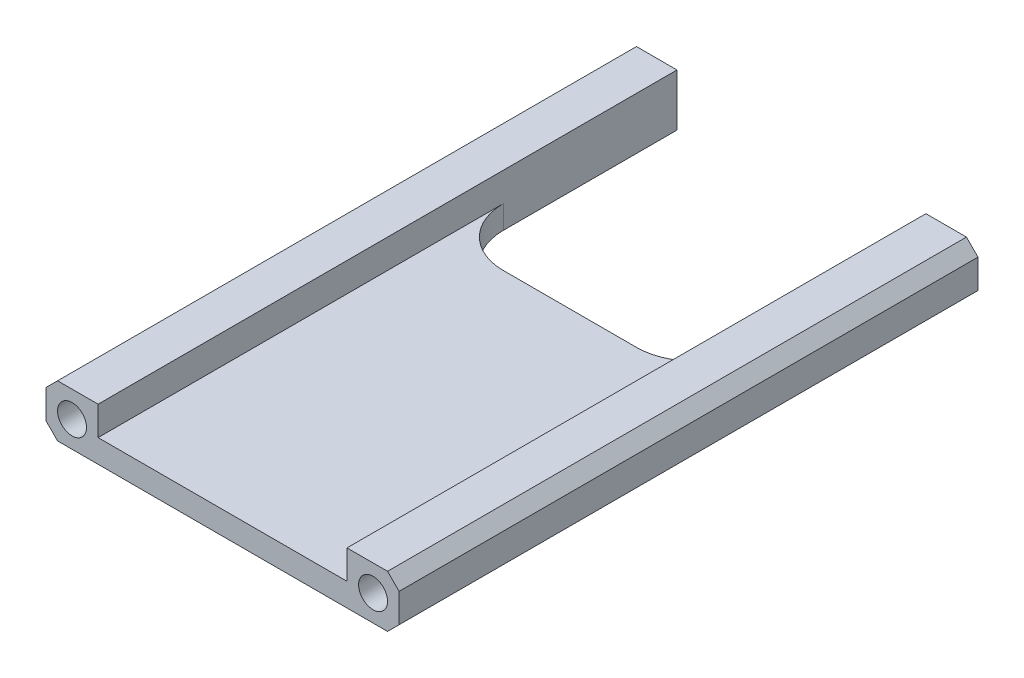
ISO-10303-21;
HEADER;
FILE_DESCRIPTION(('STEP AP214'),'2;1');
FILE_NAME('part.step','',(''),(''),'','','');
FILE_SCHEMA(('AUTOMOTIVE_DESIGN { 1 0 10303 214 1 1 1 1 }'));
ENDSEC;
DATA;
#1=APPLICATION_CONTEXT('core data for automotive mechanical design processes');
#2=APPLICATION_PROTOCOL_DEFINITION('international standard','automotive_design',2000,#1);
#3=PRODUCT_CONTEXT('',#1,'mechanical');
#4=PRODUCT('Part','Part','',(#3));
#5=PRODUCT_RELATED_PRODUCT_CATEGORY('part','',(#4));
#6=PRODUCT_DEFINITION_FORMATION('','',#4);
#7=PRODUCT_DEFINITION_CONTEXT('part definition',#1,'design');
#8=PRODUCT_DEFINITION('design','',#6,#7);
#9=PRODUCT_DEFINITION_SHAPE('','',#8);
#10=(LENGTH_UNIT() NAMED_UNIT(*) SI_UNIT(.MILLI.,.METRE.));
#11=(NAMED_UNIT(*) PLANE_ANGLE_UNIT() SI_UNIT($,.RADIAN.));
#12=(NAMED_UNIT(*) SI_UNIT($,.STERADIAN.) SOLID_ANGLE_UNIT());
#13=UNCERTAINTY_MEASURE_WITH_UNIT(LENGTH_MEASURE(1.E-05),#10,'distance_accuracy_value','');
#14=(GEOMETRIC_REPRESENTATION_CONTEXT(3) GLOBAL_UNCERTAINTY_ASSIGNED_CONTEXT((#13)) GLOBAL_UNIT_ASSIGNED_CONTEXT((#10,
#11,#12)) REPRESENTATION_CONTEXT('',''));
#15=CARTESIAN_POINT('',(0.,0.,0.));
#16=DIRECTION('',(0.,0.,1.));
#17=DIRECTION('',(1.,0.,0.));
#18=AXIS2_PLACEMENT_3D('',#15,#16,#17);
#19=CARTESIAN_POINT('',(0.,11.43,0.));
#20=DIRECTION('',(0.,-1.,0.));
#21=DIRECTION('',(0.,0.,-1.));
#22=AXIS2_PLACEMENT_3D('',#19,#20,#21);
#23=PLANE('',#22);
#24=DIRECTION('',(1.,0.,0.));
#25=VECTOR('',#24,1.);
#26=CARTESIAN_POINT('',(0.,11.43,0.));
#27=LINE('',#26,#25);
#28=CARTESIAN_POINT('',(66.04,11.43,0.));
#29=VERTEX_POINT('',#28);
#30=CARTESIAN_POINT('',(74.93,11.43,0.));
#31=VERTEX_POINT('',#30);
#32=EDGE_CURVE('E183',#29,#31,#27,.T.);
#33=ORIENTED_EDGE('',*,*,#32,.T.);
#34=DIRECTION('',(0.,0.,-1.));
#35=VECTOR('',#34,1.);
#36=CARTESIAN_POINT('',(74.93,11.43,0.));
#37=LINE('',#36,#35);
#38=CARTESIAN_POINT('',(74.93,11.43,-127.));
#39=VERTEX_POINT('',#38);
#40=EDGE_CURVE('E11',#31,#39,#37,.T.);
#41=ORIENTED_EDGE('',*,*,#40,.T.);
#42=DIRECTION('',(-1.,0.,0.));
#43=VECTOR('',#42,1.);
#44=CARTESIAN_POINT('',(0.,11.43,-127.));
#45=LINE('',#44,#43);
#46=CARTESIAN_POINT('',(66.04,11.43,-127.));
#47=VERTEX_POINT('',#46);
#48=EDGE_CURVE('E271',#39,#47,#45,.T.);
#49=ORIENTED_EDGE('',*,*,#48,.T.);
#50=DIRECTION('',(0.,0.,-1.));
#51=VECTOR('',#50,1.);
#52=CARTESIAN_POINT('',(66.04,11.43,-127.));
#53=LINE('',#52,#51);
#54=EDGE_CURVE('E208',#29,#47,#53,.T.);
#55=ORIENTED_EDGE('',*,*,#54,.F.);
#56=EDGE_LOOP('',(#33,#41,#49,#55));
#57=FACE_BOUND('',#56,.T.);
#58=ADVANCED_FACE('F40',(#57),#23,.F.);
#59=CARTESIAN_POINT('',(0.,11.43,-127.));
#60=DIRECTION('',(0.,0.,1.));
#61=DIRECTION('',(1.,0.,0.));
#62=AXIS2_PLACEMENT_3D('',#59,#60,#61);
#63=PLANE('',#62);
#64=CARTESIAN_POINT('',(71.755,5.71500000000001,-127.));
#65=DIRECTION('',(0.,0.,1.));
#66=DIRECTION('',(1.,0.,0.));
#67=AXIS2_PLACEMENT_3D('',#64,#65,#66);
#68=CIRCLE('',#67,3.175);
#69=CARTESIAN_POINT('',(74.93,5.71500000000001,-127.));
#70=VERTEX_POINT('',#69);
#71=EDGE_CURVE('E260',#70,#70,#68,.T.);
#72=ORIENTED_EDGE('',*,*,#71,.T.);
#73=EDGE_LOOP('',(#72));
#74=FACE_BOUND('',#73,.T.);
#75=DIRECTION('',(0.,-1.,0.));
#76=VECTOR('',#75,1.);
#77=CARTESIAN_POINT('',(77.47,11.43,-127.));
#78=LINE('',#77,#76);
#79=CARTESIAN_POINT('',(77.47,8.89,-127.));
#80=VERTEX_POINT('',#79);
#81=CARTESIAN_POINT('',(77.47,2.54000000000003,-127.));
#82=VERTEX_POINT('',#81);
#83=EDGE_CURVE('E285',#80,#82,#78,.T.);
#84=ORIENTED_EDGE('',*,*,#83,.T.);
#85=DIRECTION('',(-0.707106781186548,-0.707106781186548,0.));
#86=VECTOR('',#85,1.);
#87=CARTESIAN_POINT('',(77.47,2.54000000000003,-127.));
#88=LINE('',#87,#86);
#89=CARTESIAN_POINT('',(74.93,0.,-127.));
#90=VERTEX_POINT('',#89);
#91=EDGE_CURVE('E50',#82,#90,#88,.T.);
#92=ORIENTED_EDGE('',*,*,#91,.T.);
#93=DIRECTION('',(-1.,0.,0.));
#94=VECTOR('',#93,1.);
#95=CARTESIAN_POINT('',(0.,0.,-127.));
#96=LINE('',#95,#94);
#97=CARTESIAN_POINT('',(66.04,0.,-127.));
#98=VERTEX_POINT('',#97);
#99=EDGE_CURVE('E279',#90,#98,#96,.T.);
#100=ORIENTED_EDGE('',*,*,#99,.T.);
#101=DIRECTION('',(0.,1.,0.));
#102=VECTOR('',#101,1.);
#103=CARTESIAN_POINT('',(66.04,0.,-127.));
#104=LINE('',#103,#102);
#105=EDGE_CURVE('E230',#98,#47,#104,.T.);
#106=ORIENTED_EDGE('',*,*,#105,.T.);
#107=ORIENTED_EDGE('',*,*,#48,.F.);
#108=DIRECTION('',(-0.707106781186544,0.707106781186551,0.));
#109=VECTOR('',#108,1.);
#110=CARTESIAN_POINT('',(74.93,11.43,-127.));
#111=LINE('',#110,#109);
#112=EDGE_CURVE('E57',#39,#80,#111,.F.);
#113=ORIENTED_EDGE('',*,*,#112,.T.);
#114=EDGE_LOOP('',(#84,#92,#100,#106,#107,#113));
#115=FACE_BOUND('',#114,.T.);
#116=ADVANCED_FACE('F341',(#74,#115),#63,.F.);
#117=CARTESIAN_POINT('',(0.,11.43,0.));
#118=DIRECTION('',(1.,0.,0.));
#119=DIRECTION('',(0.,0.,-1.));
#120=AXIS2_PLACEMENT_3D('',#117,#118,#119);
#121=PLANE('',#120);
#122=DIRECTION('',(0.,-1.,0.));
#123=VECTOR('',#122,1.);
#124=CARTESIAN_POINT('',(0.,11.43,-127.));
#125=LINE('',#124,#123);
#126=CARTESIAN_POINT('',(0.,8.88999999999997,-127.));
#127=VERTEX_POINT('',#126);
#128=CARTESIAN_POINT('',(0.,2.54000000000003,-127.));
#129=VERTEX_POINT('',#128);
#130=EDGE_CURVE('E274',#127,#129,#125,.T.);
#131=ORIENTED_EDGE('',*,*,#130,.T.);
#132=DIRECTION('',(0.,0.,1.));
#133=VECTOR('',#132,1.);
#134=CARTESIAN_POINT('',(0.,2.54000000000003,0.));
#135=LINE('',#134,#133);
#136=CARTESIAN_POINT('',(0.,2.54000000000003,0.));
#137=VERTEX_POINT('',#136);
#138=EDGE_CURVE('E299',#129,#137,#135,.T.);
#139=ORIENTED_EDGE('',*,*,#138,.T.);
#140=DIRECTION('',(0.,-1.,0.));
#141=VECTOR('',#140,1.);
#142=CARTESIAN_POINT('',(0.,11.43,0.));
#143=LINE('',#142,#141);
#144=CARTESIAN_POINT('',(0.,8.88999999999997,0.));
#145=VERTEX_POINT('',#144);
#146=EDGE_CURVE('E293',#145,#137,#143,.T.);
#147=ORIENTED_EDGE('',*,*,#146,.F.);
#148=DIRECTION('',(0.,0.,-1.));
#149=VECTOR('',#148,1.);
#150=CARTESIAN_POINT('',(0.,8.88999999999997,0.));
#151=LINE('',#150,#149);
#152=EDGE_CURVE('E296',#145,#127,#151,.T.);
#153=ORIENTED_EDGE('',*,*,#152,.T.);
#154=EDGE_LOOP('',(#131,#139,#147,#153));
#155=FACE_BOUND('',#154,.T.);
#156=ADVANCED_FACE('F372',(#155),#121,.F.);
#157=CARTESIAN_POINT('',(0.,11.43,0.));
#158=DIRECTION('',(0.,0.,-1.));
#159=DIRECTION('',(-1.,0.,0.));
#160=AXIS2_PLACEMENT_3D('',#157,#158,#159);
#161=PLANE('',#160);
#162=ORIENTED_EDGE('',*,*,#146,.T.);
#163=DIRECTION('',(0.707106781186548,-0.707106781186548,0.));
#164=VECTOR('',#163,1.);
#165=CARTESIAN_POINT('',(0.,2.54000000000003,0.));
#166=LINE('',#165,#164);
#167=CARTESIAN_POINT('',(2.54000000000003,0.,0.));
#168=VERTEX_POINT('',#167);
#169=EDGE_CURVE('E312',#137,#168,#166,.T.);
#170=ORIENTED_EDGE('',*,*,#169,.T.);
#171=DIRECTION('',(1.,0.,0.));
#172=VECTOR('',#171,1.);
#173=CARTESIAN_POINT('',(0.,0.,0.));
#174=LINE('',#173,#172);
#175=CARTESIAN_POINT('',(74.93,0.,0.));
#176=VERTEX_POINT('',#175);
#177=EDGE_CURVE('E255',#168,#176,#174,.T.);
#178=ORIENTED_EDGE('',*,*,#177,.T.);
#179=DIRECTION('',(0.707106781186548,0.707106781186548,0.));
#180=VECTOR('',#179,1.);
#181=CARTESIAN_POINT('',(77.47,2.54000000000003,0.));
#182=LINE('',#181,#180);
#183=CARTESIAN_POINT('',(77.47,2.54000000000003,0.));
#184=VERTEX_POINT('',#183);
#185=EDGE_CURVE('E306',#176,#184,#182,.T.);
#186=ORIENTED_EDGE('',*,*,#185,.T.);
#187=DIRECTION('',(0.,-1.,0.));
#188=VECTOR('',#187,1.);
#189=CARTESIAN_POINT('',(77.47,11.43,0.));
#190=LINE('',#189,#188);
#191=CARTESIAN_POINT('',(77.47,8.89,0.));
#192=VERTEX_POINT('',#191);
#193=EDGE_CURVE('E289',#192,#184,#190,.T.);
#194=ORIENTED_EDGE('',*,*,#193,.F.);
#195=DIRECTION('',(0.707106781186544,-0.707106781186551,0.));
#196=VECTOR('',#195,1.);
#197=CARTESIAN_POINT('',(74.93,11.43,0.));
#198=LINE('',#197,#196);
#199=EDGE_CURVE('E303',#192,#31,#198,.F.);
#200=ORIENTED_EDGE('',*,*,#199,.T.);
#201=ORIENTED_EDGE('',*,*,#32,.F.);
#202=DIRECTION('',(0.,-1.,0.));
#203=VECTOR('',#202,1.);
#204=CARTESIAN_POINT('',(66.04,11.43,0.));
#205=LINE('',#204,#203);
#206=CARTESIAN_POINT('',(66.04,5.08,0.));
#207=VERTEX_POINT('',#206);
#208=EDGE_CURVE('E160',#29,#207,#205,.T.);
#209=ORIENTED_EDGE('',*,*,#208,.T.);
#210=DIRECTION('',(-1.,0.,0.));
#211=VECTOR('',#210,1.);
#212=CARTESIAN_POINT('',(66.04,5.08,0.));
#213=LINE('',#212,#211);
#214=CARTESIAN_POINT('',(11.43,5.08,0.));
#215=VERTEX_POINT('',#214);
#216=EDGE_CURVE('E171',#207,#215,#213,.T.);
#217=ORIENTED_EDGE('',*,*,#216,.T.);
#218=DIRECTION('',(0.,1.,0.));
#219=VECTOR('',#218,1.);
#220=CARTESIAN_POINT('',(11.43,11.43,0.));
#221=LINE('',#220,#219);
#222=CARTESIAN_POINT('',(11.43,11.43,0.));
#223=VERTEX_POINT('',#222);
#224=EDGE_CURVE('E168',#215,#223,#221,.T.);
#225=ORIENTED_EDGE('',*,*,#224,.T.);
#226=CARTESIAN_POINT('',(2.54000000000003,11.43,0.));
#227=VERTEX_POINT('',#226);
#228=EDGE_CURVE('E267',#227,#223,#27,.T.);
#229=ORIENTED_EDGE('',*,*,#228,.F.);
#230=DIRECTION('',(0.707106781186548,0.707106781186548,0.));
#231=VECTOR('',#230,1.);
#232=CARTESIAN_POINT('',(2.54000000000003,11.43,0.));
#233=LINE('',#232,#231);
#234=EDGE_CURVE('E309',#227,#145,#233,.F.);
#235=ORIENTED_EDGE('',*,*,#234,.T.);
#236=EDGE_LOOP('',(#162,#170,#178,#186,#194,#200,#201,#209,#217,#225,#229,#235));
#237=FACE_BOUND('',#236,.T.);
#238=CARTESIAN_POINT('',(5.715,5.715,0.));
#239=DIRECTION('',(0.,0.,1.));
#240=DIRECTION('',(1.,0.,0.));
#241=AXIS2_PLACEMENT_3D('',#238,#239,#240);
#242=CIRCLE('',#241,3.175);
#243=CARTESIAN_POINT('',(8.89,5.715,0.));
#244=VERTEX_POINT('',#243);
#245=EDGE_CURVE('E256',#244,#244,#242,.T.);
#246=ORIENTED_EDGE('',*,*,#245,.F.);
#247=EDGE_LOOP('',(#246));
#248=FACE_BOUND('',#247,.T.);
#249=CARTESIAN_POINT('',(71.755,5.71500000000001,0.));
#250=DIRECTION('',(0.,0.,1.));
#251=DIRECTION('',(1.,0.,0.));
#252=AXIS2_PLACEMENT_3D('',#249,#250,#251);
#253=CIRCLE('',#252,3.175);
#254=CARTESIAN_POINT('',(74.93,5.71500000000001,0.));
#255=VERTEX_POINT('',#254);
#256=EDGE_CURVE('E234',#255,#255,#253,.T.);
#257=ORIENTED_EDGE('',*,*,#256,.F.);
#258=EDGE_LOOP('',(#257));
#259=FACE_BOUND('',#258,.T.);
#260=ADVANCED_FACE('F180',(#237,#248,#259),#161,.F.);
#261=CARTESIAN_POINT('',(77.47,11.43,0.));
#262=DIRECTION('',(-1.,0.,0.));
#263=DIRECTION('',(0.,0.,1.));
#264=AXIS2_PLACEMENT_3D('',#261,#262,#263);
#265=PLANE('',#264);
#266=ORIENTED_EDGE('',*,*,#193,.T.);
#267=DIRECTION('',(0.,0.,-1.));
#268=VECTOR('',#267,1.);
#269=CARTESIAN_POINT('',(77.47,2.54000000000003,-127.));
#270=LINE('',#269,#268);
#271=EDGE_CURVE('E334',#184,#82,#270,.T.);
#272=ORIENTED_EDGE('',*,*,#271,.T.);
#273=ORIENTED_EDGE('',*,*,#83,.F.);
#274=DIRECTION('',(0.,0.,1.));
#275=VECTOR('',#274,1.);
#276=CARTESIAN_POINT('',(77.47,8.89,0.));
#277=LINE('',#276,#275);
#278=EDGE_CURVE('E331',#80,#192,#277,.T.);
#279=ORIENTED_EDGE('',*,*,#278,.T.);
#280=EDGE_LOOP('',(#266,#272,#273,#279));
#281=FACE_BOUND('',#280,.T.);
#282=ADVANCED_FACE('F352',(#281),#265,.F.);
#283=CARTESIAN_POINT('',(5.715,5.715,-127.));
#284=DIRECTION('',(0.,0.,1.));
#285=DIRECTION('',(1.,0.,0.));
#286=AXIS2_PLACEMENT_3D('',#283,#284,#285);
#287=CIRCLE('',#286,3.175);
#288=CARTESIAN_POINT('',(8.89,5.715,-127.));
#289=VERTEX_POINT('',#288);
#290=EDGE_CURVE('E251',#289,#289,#287,.T.);
#291=ORIENTED_EDGE('',*,*,#290,.T.);
#292=EDGE_LOOP('',(#291));
#293=FACE_BOUND('',#292,.T.);
#294=CARTESIAN_POINT('',(11.43,0.,-127.));
#295=VERTEX_POINT('',#294);
#296=CARTESIAN_POINT('',(2.54000000000003,0.,-127.));
#297=VERTEX_POINT('',#296);
#298=EDGE_CURVE('E278',#295,#297,#96,.T.);
#299=ORIENTED_EDGE('',*,*,#298,.T.);
#300=DIRECTION('',(-0.707106781186548,0.707106781186548,0.));
#301=VECTOR('',#300,1.);
#302=CARTESIAN_POINT('',(0.,2.54000000000003,-127.));
#303=LINE('',#302,#301);
#304=EDGE_CURVE('E324',#297,#129,#303,.T.);
#305=ORIENTED_EDGE('',*,*,#304,.T.);
#306=ORIENTED_EDGE('',*,*,#130,.F.);
#307=DIRECTION('',(-0.707106781186548,-0.707106781186548,0.));
#308=VECTOR('',#307,1.);
#309=CARTESIAN_POINT('',(2.54000000000003,11.43,-127.));
#310=LINE('',#309,#308);
#311=CARTESIAN_POINT('',(2.54000000000003,11.43,-127.));
#312=VERTEX_POINT('',#311);
#313=EDGE_CURVE('E321',#127,#312,#310,.F.);
#314=ORIENTED_EDGE('',*,*,#313,.T.);
#315=CARTESIAN_POINT('',(11.43,11.43,-127.));
#316=VERTEX_POINT('',#315);
#317=EDGE_CURVE('E270',#316,#312,#45,.T.);
#318=ORIENTED_EDGE('',*,*,#317,.F.);
#319=DIRECTION('',(0.,1.,0.));
#320=VECTOR('',#319,1.);
#321=CARTESIAN_POINT('',(11.43,0.,-127.));
#322=LINE('',#321,#320);
#323=EDGE_CURVE('E224',#295,#316,#322,.T.);
#324=ORIENTED_EDGE('',*,*,#323,.F.);
#325=EDGE_LOOP('',(#299,#305,#306,#314,#318,#324));
#326=FACE_BOUND('',#325,.T.);
#327=ADVANCED_FACE('F363',(#293,#326),#63,.F.);
#328=ORIENTED_EDGE('',*,*,#317,.T.);
#329=DIRECTION('',(0.,0.,1.));
#330=VECTOR('',#329,1.);
#331=CARTESIAN_POINT('',(2.54000000000003,11.43,0.));
#332=LINE('',#331,#330);
#333=EDGE_CURVE('E327',#312,#227,#332,.T.);
#334=ORIENTED_EDGE('',*,*,#333,.T.);
#335=ORIENTED_EDGE('',*,*,#228,.T.);
#336=DIRECTION('',(0.,0.,1.));
#337=VECTOR('',#336,1.);
#338=CARTESIAN_POINT('',(11.43,11.43,-127.));
#339=LINE('',#338,#337);
#340=EDGE_CURVE('E202',#316,#223,#339,.T.);
#341=ORIENTED_EDGE('',*,*,#340,.F.);
#342=EDGE_LOOP('',(#328,#334,#335,#341));
#343=FACE_BOUND('',#342,.T.);
#344=ADVANCED_FACE('F381',(#343),#23,.F.);
#345=CARTESIAN_POINT('',(0.,0.,0.));
#346=DIRECTION('',(0.,-1.,0.));
#347=DIRECTION('',(0.,0.,-1.));
#348=AXIS2_PLACEMENT_3D('',#345,#346,#347);
#349=PLANE('',#348);
#350=ORIENTED_EDGE('',*,*,#177,.F.);
#351=DIRECTION('',(0.,0.,-1.));
#352=VECTOR('',#351,1.);
#353=CARTESIAN_POINT('',(2.54000000000003,0.,-127.));
#354=LINE('',#353,#352);
#355=EDGE_CURVE('E318',#168,#297,#354,.T.);
#356=ORIENTED_EDGE('',*,*,#355,.T.);
#357=ORIENTED_EDGE('',*,*,#298,.F.);
#358=DIRECTION('',(0.,0.,1.));
#359=VECTOR('',#358,1.);
#360=CARTESIAN_POINT('',(11.43,0.,-127.));
#361=LINE('',#360,#359);
#362=CARTESIAN_POINT('',(11.43,0.,-88.9));
#363=VERTEX_POINT('',#362);
#364=EDGE_CURVE('E203',#295,#363,#361,.T.);
#365=ORIENTED_EDGE('',*,*,#364,.T.);
#366=CARTESIAN_POINT('',(24.13,0.,-88.9));
#367=DIRECTION('',(0.,1.,0.));
#368=DIRECTION('',(0.,0.,-1.));
#369=AXIS2_PLACEMENT_3D('',#366,#367,#368);
#370=CIRCLE('',#369,12.7);
#371=CARTESIAN_POINT('',(24.13,0.,-76.2));
#372=VERTEX_POINT('',#371);
#373=EDGE_CURVE('E207',#363,#372,#370,.T.);
#374=ORIENTED_EDGE('',*,*,#373,.T.);
#375=DIRECTION('',(1.,0.,0.));
#376=VECTOR('',#375,1.);
#377=CARTESIAN_POINT('',(53.34,0.,-76.2000000000001));
#378=LINE('',#377,#376);
#379=CARTESIAN_POINT('',(53.34,0.,-76.2000000000001));
#380=VERTEX_POINT('',#379);
#381=EDGE_CURVE('E212',#372,#380,#378,.T.);
#382=ORIENTED_EDGE('',*,*,#381,.T.);
#383=CARTESIAN_POINT('',(53.34,0.,-88.9));
#384=DIRECTION('',(0.,1.,0.));
#385=DIRECTION('',(0.,0.,-1.));
#386=AXIS2_PLACEMENT_3D('',#383,#384,#385);
#387=CIRCLE('',#386,12.7);
#388=CARTESIAN_POINT('',(66.04,0.,-88.9));
#389=VERTEX_POINT('',#388);
#390=EDGE_CURVE('E216',#380,#389,#387,.T.);
#391=ORIENTED_EDGE('',*,*,#390,.T.);
#392=DIRECTION('',(0.,0.,-1.));
#393=VECTOR('',#392,1.);
#394=CARTESIAN_POINT('',(66.04,0.,-127.));
#395=LINE('',#394,#393);
#396=EDGE_CURVE('E220',#389,#98,#395,.T.);
#397=ORIENTED_EDGE('',*,*,#396,.T.);
#398=ORIENTED_EDGE('',*,*,#99,.F.);
#399=DIRECTION('',(0.,0.,1.));
#400=VECTOR('',#399,1.);
#401=CARTESIAN_POINT('',(74.93,0.,0.));
#402=LINE('',#401,#400);
#403=EDGE_CURVE('E315',#90,#176,#402,.T.);
#404=ORIENTED_EDGE('',*,*,#403,.T.);
#405=EDGE_LOOP('',(#350,#356,#357,#365,#374,#382,#391,#397,#398,#404));
#406=FACE_BOUND('',#405,.T.);
#407=ADVANCED_FACE('F346',(#406),#349,.T.);
#408=CARTESIAN_POINT('',(71.755,5.71500000000001,-127.));
#409=DIRECTION('',(0.,0.,1.));
#410=DIRECTION('',(1.,0.,0.));
#411=AXIS2_PLACEMENT_3D('',#408,#409,#410);
#412=CYLINDRICAL_SURFACE('',#411,3.175);
#413=ORIENTED_EDGE('',*,*,#71,.F.);
#414=EDGE_LOOP('',(#413));
#415=FACE_BOUND('',#414,.T.);
#416=ORIENTED_EDGE('',*,*,#256,.T.);
#417=EDGE_LOOP('',(#416));
#418=FACE_BOUND('',#417,.T.);
#419=ADVANCED_FACE('F418',(#415,#418),#412,.F.);
#420=CARTESIAN_POINT('',(5.715,5.715,-127.));
#421=DIRECTION('',(0.,0.,1.));
#422=DIRECTION('',(1.,0.,0.));
#423=AXIS2_PLACEMENT_3D('',#420,#421,#422);
#424=CYLINDRICAL_SURFACE('',#423,3.175);
#425=ORIENTED_EDGE('',*,*,#290,.F.);
#426=EDGE_LOOP('',(#425));
#427=FACE_BOUND('',#426,.T.);
#428=ORIENTED_EDGE('',*,*,#245,.T.);
#429=EDGE_LOOP('',(#428));
#430=FACE_BOUND('',#429,.T.);
#431=ADVANCED_FACE('F401',(#427,#430),#424,.F.);
#432=CARTESIAN_POINT('',(66.04,0.,-127.));
#433=DIRECTION('',(1.,0.,0.));
#434=DIRECTION('',(0.,0.,-1.));
#435=AXIS2_PLACEMENT_3D('',#432,#433,#434);
#436=PLANE('',#435);
#437=DIRECTION('',(0.,1.,0.));
#438=VECTOR('',#437,1.);
#439=CARTESIAN_POINT('',(66.04,0.,-88.9));
#440=LINE('',#439,#438);
#441=CARTESIAN_POINT('',(66.04,5.08,-88.9));
#442=VERTEX_POINT('',#441);
#443=EDGE_CURVE('E163',#389,#442,#440,.T.);
#444=ORIENTED_EDGE('',*,*,#443,.T.);
#445=DIRECTION('',(0.,0.,-1.));
#446=VECTOR('',#445,1.);
#447=CARTESIAN_POINT('',(66.04,5.08,0.));
#448=LINE('',#447,#446);
#449=EDGE_CURVE('E155',#207,#442,#448,.T.);
#450=ORIENTED_EDGE('',*,*,#449,.F.);
#451=ORIENTED_EDGE('',*,*,#208,.F.);
#452=ORIENTED_EDGE('',*,*,#54,.T.);
#453=ORIENTED_EDGE('',*,*,#105,.F.);
#454=ORIENTED_EDGE('',*,*,#396,.F.);
#455=EDGE_LOOP('',(#444,#450,#451,#452,#453,#454));
#456=FACE_BOUND('',#455,.T.);
#457=ADVANCED_FACE('F157',(#456),#436,.F.);
#458=CARTESIAN_POINT('',(53.34,0.,-88.9));
#459=DIRECTION('',(0.,1.,0.));
#460=DIRECTION('',(0.,0.,1.));
#461=AXIS2_PLACEMENT_3D('',#458,#459,#460);
#462=CYLINDRICAL_SURFACE('',#461,12.7);
#463=DIRECTION('',(0.,1.,0.));
#464=VECTOR('',#463,1.);
#465=CARTESIAN_POINT('',(53.34,0.,-76.2000000000001));
#466=LINE('',#465,#464);
#467=CARTESIAN_POINT('',(53.34,5.08,-76.2000000000001));
#468=VERTEX_POINT('',#467);
#469=EDGE_CURVE('E237',#380,#468,#466,.T.);
#470=ORIENTED_EDGE('',*,*,#469,.T.);
#471=CARTESIAN_POINT('',(53.34,5.08,-88.9));
#472=DIRECTION('',(0.,-1.,0.));
#473=DIRECTION('',(0.,0.,-1.));
#474=AXIS2_PLACEMENT_3D('',#471,#472,#473);
#475=CIRCLE('',#474,12.7);
#476=EDGE_CURVE('E199',#468,#442,#475,.F.);
#477=ORIENTED_EDGE('',*,*,#476,.T.);
#478=ORIENTED_EDGE('',*,*,#443,.F.);
#479=ORIENTED_EDGE('',*,*,#390,.F.);
#480=EDGE_LOOP('',(#470,#477,#478,#479));
#481=FACE_BOUND('',#480,.T.);
#482=ADVANCED_FACE('F393',(#481),#462,.F.);
#483=CARTESIAN_POINT('',(53.34,0.,-76.2000000000001));
#484=DIRECTION('',(0.,0.,1.));
#485=DIRECTION('',(1.,0.,0.));
#486=AXIS2_PLACEMENT_3D('',#483,#484,#485);
#487=PLANE('',#486);
#488=DIRECTION('',(0.,1.,0.));
#489=VECTOR('',#488,1.);
#490=CARTESIAN_POINT('',(24.13,0.,-76.2));
#491=LINE('',#490,#489);
#492=CARTESIAN_POINT('',(24.13,5.08,-76.2));
#493=VERTEX_POINT('',#492);
#494=EDGE_CURVE('E241',#372,#493,#491,.T.);
#495=ORIENTED_EDGE('',*,*,#494,.T.);
#496=DIRECTION('',(1.,0.,0.));
#497=VECTOR('',#496,1.);
#498=CARTESIAN_POINT('',(53.34,5.08,-76.2000000000001));
#499=LINE('',#498,#497);
#500=EDGE_CURVE('E195',#493,#468,#499,.T.);
#501=ORIENTED_EDGE('',*,*,#500,.T.);
#502=ORIENTED_EDGE('',*,*,#469,.F.);
#503=ORIENTED_EDGE('',*,*,#381,.F.);
#504=EDGE_LOOP('',(#495,#501,#502,#503));
#505=FACE_BOUND('',#504,.T.);
#506=ADVANCED_FACE('F390',(#505),#487,.F.);
#507=CARTESIAN_POINT('',(24.13,0.,-88.9));
#508=DIRECTION('',(0.,1.,0.));
#509=DIRECTION('',(0.,0.,1.));
#510=AXIS2_PLACEMENT_3D('',#507,#508,#509);
#511=CYLINDRICAL_SURFACE('',#510,12.7);
#512=DIRECTION('',(0.,1.,0.));
#513=VECTOR('',#512,1.);
#514=CARTESIAN_POINT('',(11.43,0.,-88.9));
#515=LINE('',#514,#513);
#516=CARTESIAN_POINT('',(11.43,5.08,-88.9));
#517=VERTEX_POINT('',#516);
#518=EDGE_CURVE('E245',#363,#517,#515,.T.);
#519=ORIENTED_EDGE('',*,*,#518,.T.);
#520=CARTESIAN_POINT('',(24.13,5.08,-88.9));
#521=DIRECTION('',(0.,-1.,0.));
#522=DIRECTION('',(0.,0.,-1.));
#523=AXIS2_PLACEMENT_3D('',#520,#521,#522);
#524=CIRCLE('',#523,12.7);
#525=EDGE_CURVE('E190',#517,#493,#524,.F.);
#526=ORIENTED_EDGE('',*,*,#525,.T.);
#527=ORIENTED_EDGE('',*,*,#494,.F.);
#528=ORIENTED_EDGE('',*,*,#373,.F.);
#529=EDGE_LOOP('',(#519,#526,#527,#528));
#530=FACE_BOUND('',#529,.T.);
#531=ADVANCED_FACE('F388',(#530),#511,.F.);
#532=CARTESIAN_POINT('',(11.43,0.,-127.));
#533=DIRECTION('',(-1.,0.,0.));
#534=DIRECTION('',(0.,0.,1.));
#535=AXIS2_PLACEMENT_3D('',#532,#533,#534);
#536=PLANE('',#535);
#537=ORIENTED_EDGE('',*,*,#323,.T.);
#538=ORIENTED_EDGE('',*,*,#340,.T.);
#539=ORIENTED_EDGE('',*,*,#224,.F.);
#540=DIRECTION('',(0.,0.,-1.));
#541=VECTOR('',#540,1.);
#542=CARTESIAN_POINT('',(11.43,5.08,0.));
#543=LINE('',#542,#541);
#544=EDGE_CURVE('E167',#215,#517,#543,.T.);
#545=ORIENTED_EDGE('',*,*,#544,.T.);
#546=ORIENTED_EDGE('',*,*,#518,.F.);
#547=ORIENTED_EDGE('',*,*,#364,.F.);
#548=EDGE_LOOP('',(#537,#538,#539,#545,#546,#547));
#549=FACE_BOUND('',#548,.T.);
#550=ADVANCED_FACE('F384',(#549),#536,.F.);
#551=CARTESIAN_POINT('',(66.04,5.08,0.));
#552=DIRECTION('',(0.,-1.,0.));
#553=DIRECTION('',(0.,0.,-1.));
#554=AXIS2_PLACEMENT_3D('',#551,#552,#553);
#555=PLANE('',#554);
#556=ORIENTED_EDGE('',*,*,#500,.F.);
#557=ORIENTED_EDGE('',*,*,#525,.F.);
#558=ORIENTED_EDGE('',*,*,#544,.F.);
#559=ORIENTED_EDGE('',*,*,#216,.F.);
#560=ORIENTED_EDGE('',*,*,#449,.T.);
#561=ORIENTED_EDGE('',*,*,#476,.F.);
#562=EDGE_LOOP('',(#556,#557,#558,#559,#560,#561));
#563=FACE_BOUND('',#562,.T.);
#564=ADVANCED_FACE('F172',(#563),#555,.F.);
#565=CARTESIAN_POINT('',(0.,2.54000000000003,0.));
#566=DIRECTION('',(-0.707106781186547,-0.707106781186547,0.));
#567=DIRECTION('',(0.,0.,-1.));
#568=AXIS2_PLACEMENT_3D('',#565,#566,#567);
#569=PLANE('',#568);
#570=ORIENTED_EDGE('',*,*,#304,.F.);
#571=ORIENTED_EDGE('',*,*,#355,.F.);
#572=ORIENTED_EDGE('',*,*,#169,.F.);
#573=ORIENTED_EDGE('',*,*,#138,.F.);
#574=EDGE_LOOP('',(#570,#571,#572,#573));
#575=FACE_BOUND('',#574,.T.);
#576=ADVANCED_FACE('F369',(#575),#569,.T.);
#577=CARTESIAN_POINT('',(2.54000000000003,11.43,0.));
#578=DIRECTION('',(0.707106781186547,-0.707106781186547,0.));
#579=DIRECTION('',(0.,0.,1.));
#580=AXIS2_PLACEMENT_3D('',#577,#578,#579);
#581=PLANE('',#580);
#582=ORIENTED_EDGE('',*,*,#313,.F.);
#583=ORIENTED_EDGE('',*,*,#152,.F.);
#584=ORIENTED_EDGE('',*,*,#234,.F.);
#585=ORIENTED_EDGE('',*,*,#333,.F.);
#586=EDGE_LOOP('',(#582,#583,#584,#585));
#587=FACE_BOUND('',#586,.T.);
#588=ADVANCED_FACE('F378',(#587),#581,.F.);
#589=CARTESIAN_POINT('',(77.47,2.54000000000003,0.));
#590=DIRECTION('',(0.707106781186547,-0.707106781186547,0.));
#591=DIRECTION('',(0.,0.,1.));
#592=AXIS2_PLACEMENT_3D('',#589,#590,#591);
#593=PLANE('',#592);
#594=ORIENTED_EDGE('',*,*,#185,.F.);
#595=ORIENTED_EDGE('',*,*,#403,.F.);
#596=ORIENTED_EDGE('',*,*,#91,.F.);
#597=ORIENTED_EDGE('',*,*,#271,.F.);
#598=EDGE_LOOP('',(#594,#595,#596,#597));
#599=FACE_BOUND('',#598,.T.);
#600=ADVANCED_FACE('F348',(#599),#593,.T.);
#601=CARTESIAN_POINT('',(74.93,11.43,0.));
#602=DIRECTION('',(-0.707106781186551,-0.707106781186544,0.));
#603=DIRECTION('',(0.,0.,-1.));
#604=AXIS2_PLACEMENT_3D('',#601,#602,#603);
#605=PLANE('',#604);
#606=ORIENTED_EDGE('',*,*,#199,.F.);
#607=ORIENTED_EDGE('',*,*,#278,.F.);
#608=ORIENTED_EDGE('',*,*,#112,.F.);
#609=ORIENTED_EDGE('',*,*,#40,.F.);
#610=EDGE_LOOP('',(#606,#607,#608,#609));
#611=FACE_BOUND('',#610,.T.);
#612=ADVANCED_FACE('F43',(#611),#605,.F.);
#613=CLOSED_SHELL('',(#58,#116,#156,#260,#282,#327,#344,#407,#419,#431,#457,#482,#506,#531,#550,
#564,#576,#588,#600,#612));
#614=MANIFOLD_SOLID_BREP('B2',#613);
#615=ADVANCED_BREP_SHAPE_REPRESENTATION('',(#18,#614),#14);
#616=SHAPE_DEFINITION_REPRESENTATION(#9,#615);
ENDSEC;
END-ISO-10303-21;
